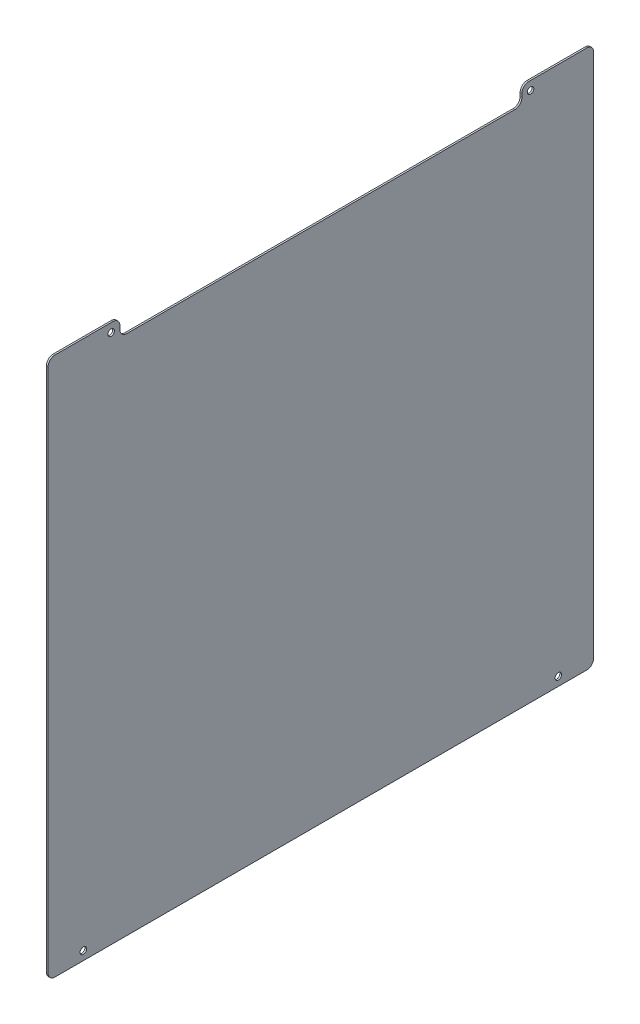
ISO-10303-21;
HEADER;
FILE_DESCRIPTION(('STEP AP214'),'2;1');
FILE_NAME('part.step','',(''),(''),'','','');
FILE_SCHEMA(('AUTOMOTIVE_DESIGN { 1 0 10303 214 1 1 1 1 }'));
ENDSEC;
DATA;
#1=APPLICATION_CONTEXT('core data for automotive mechanical design processes');
#2=APPLICATION_PROTOCOL_DEFINITION('international standard','automotive_design',2000,#1);
#3=PRODUCT_CONTEXT('',#1,'mechanical');
#4=PRODUCT('Part','Part','',(#3));
#5=PRODUCT_RELATED_PRODUCT_CATEGORY('part','',(#4));
#6=PRODUCT_DEFINITION_FORMATION('','',#4);
#7=PRODUCT_DEFINITION_CONTEXT('part definition',#1,'design');
#8=PRODUCT_DEFINITION('design','',#6,#7);
#9=PRODUCT_DEFINITION_SHAPE('','',#8);
#10=(LENGTH_UNIT() NAMED_UNIT(*) SI_UNIT(.MILLI.,.METRE.));
#11=(NAMED_UNIT(*) PLANE_ANGLE_UNIT() SI_UNIT($,.RADIAN.));
#12=(NAMED_UNIT(*) SI_UNIT($,.STERADIAN.) SOLID_ANGLE_UNIT());
#13=UNCERTAINTY_MEASURE_WITH_UNIT(LENGTH_MEASURE(1.E-05),#10,'distance_accuracy_value','');
#14=(GEOMETRIC_REPRESENTATION_CONTEXT(3) GLOBAL_UNCERTAINTY_ASSIGNED_CONTEXT((#13)) GLOBAL_UNIT_ASSIGNED_CONTEXT((#10,
#11,#12)) REPRESENTATION_CONTEXT('',''));
#15=CARTESIAN_POINT('',(0.,0.,0.));
#16=DIRECTION('',(0.,0.,1.));
#17=DIRECTION('',(1.,0.,0.));
#18=AXIS2_PLACEMENT_3D('',#15,#16,#17);
#19=CARTESIAN_POINT('',(-1.5875,6.35,-6.35));
#20=DIRECTION('',(1.,0.,0.));
#21=DIRECTION('',(0.,0.,-1.));
#22=AXIS2_PLACEMENT_3D('',#19,#20,#21);
#23=CYLINDRICAL_SURFACE('',#22,6.35);
#24=CARTESIAN_POINT('',(0.,6.35,-6.35));
#25=DIRECTION('',(1.,0.,0.));
#26=DIRECTION('',(0.,0.,1.));
#27=AXIS2_PLACEMENT_3D('',#24,#25,#26);
#28=CIRCLE('',#27,6.35);
#29=CARTESIAN_POINT('',(0.,6.35000000000004,0.));
#30=VERTEX_POINT('',#29);
#31=CARTESIAN_POINT('',(0.,0.,-6.35000000000004));
#32=VERTEX_POINT('',#31);
#33=EDGE_CURVE('E181',#30,#32,#28,.T.);
#34=ORIENTED_EDGE('',*,*,#33,.F.);
#35=DIRECTION('',(1.,0.,0.));
#36=VECTOR('',#35,1.);
#37=CARTESIAN_POINT('',(-1.5875,6.35000000000004,0.));
#38=LINE('',#37,#36);
#39=CARTESIAN_POINT('',(-1.5875,6.35000000000004,0.));
#40=VERTEX_POINT('',#39);
#41=EDGE_CURVE('E11',#40,#30,#38,.T.);
#42=ORIENTED_EDGE('',*,*,#41,.F.);
#43=CARTESIAN_POINT('',(-1.5875,6.35,-6.35));
#44=DIRECTION('',(1.,0.,0.));
#45=DIRECTION('',(0.,0.,1.));
#46=AXIS2_PLACEMENT_3D('',#43,#44,#45);
#47=CIRCLE('',#46,6.35);
#48=CARTESIAN_POINT('',(-1.5875,0.,-6.35000000000004));
#49=VERTEX_POINT('',#48);
#50=EDGE_CURVE('E226',#40,#49,#47,.T.);
#51=ORIENTED_EDGE('',*,*,#50,.T.);
#52=DIRECTION('',(1.,0.,0.));
#53=VECTOR('',#52,1.);
#54=CARTESIAN_POINT('',(-1.5875,0.,-6.35000000000004));
#55=LINE('',#54,#53);
#56=EDGE_CURVE('E115',#49,#32,#55,.T.);
#57=ORIENTED_EDGE('',*,*,#56,.T.);
#58=EDGE_LOOP('',(#34,#42,#51,#57));
#59=FACE_BOUND('',#58,.T.);
#60=ADVANCED_FACE('F35',(#59),#23,.T.);
#61=CARTESIAN_POINT('',(-1.5875,6.35000000000004,0.));
#62=DIRECTION('',(0.,0.,1.));
#63=DIRECTION('',(0.,-1.,0.));
#64=AXIS2_PLACEMENT_3D('',#61,#62,#63);
#65=PLANE('',#64);
#66=DIRECTION('',(0.,-1.,0.));
#67=VECTOR('',#66,1.);
#68=CARTESIAN_POINT('',(0.,6.35000000000004,0.));
#69=LINE('',#68,#67);
#70=CARTESIAN_POINT('',(0.,485.14,2.30718222304915E-13));
#71=VERTEX_POINT('',#70);
#72=EDGE_CURVE('E224',#71,#30,#69,.T.);
#73=ORIENTED_EDGE('',*,*,#72,.F.);
#74=DIRECTION('',(1.,0.,0.));
#75=VECTOR('',#74,1.);
#76=CARTESIAN_POINT('',(-1.5875,485.14,2.30718222304915E-13));
#77=LINE('',#76,#75);
#78=CARTESIAN_POINT('',(-1.5875,485.14,2.30718222304915E-13));
#79=VERTEX_POINT('',#78);
#80=EDGE_CURVE('E44',#79,#71,#77,.T.);
#81=ORIENTED_EDGE('',*,*,#80,.F.);
#82=DIRECTION('',(0.,-1.,0.));
#83=VECTOR('',#82,1.);
#84=CARTESIAN_POINT('',(-1.5875,6.35000000000004,0.));
#85=LINE('',#84,#83);
#86=EDGE_CURVE('E171',#79,#40,#85,.T.);
#87=ORIENTED_EDGE('',*,*,#86,.T.);
#88=ORIENTED_EDGE('',*,*,#41,.T.);
#89=EDGE_LOOP('',(#73,#81,#87,#88));
#90=FACE_BOUND('',#89,.T.);
#91=ADVANCED_FACE('F339',(#90),#65,.T.);
#92=CARTESIAN_POINT('',(-1.5875,485.14,-6.34999999999978));
#93=DIRECTION('',(1.,0.,0.));
#94=DIRECTION('',(0.,0.,-1.));
#95=AXIS2_PLACEMENT_3D('',#92,#93,#94);
#96=CYLINDRICAL_SURFACE('',#95,6.35000000000001);
#97=CARTESIAN_POINT('',(0.,485.14,-6.34999999999978));
#98=DIRECTION('',(1.,0.,0.));
#99=DIRECTION('',(0.,0.,-1.));
#100=AXIS2_PLACEMENT_3D('',#97,#98,#99);
#101=CIRCLE('',#100,6.35000000000001);
#102=CARTESIAN_POINT('',(0.,491.49,-6.34999999999982));
#103=VERTEX_POINT('',#102);
#104=EDGE_CURVE('E158',#103,#71,#101,.T.);
#105=ORIENTED_EDGE('',*,*,#104,.F.);
#106=DIRECTION('',(1.,0.,0.));
#107=VECTOR('',#106,1.);
#108=CARTESIAN_POINT('',(-1.5875,491.49,-6.34999999999982));
#109=LINE('',#108,#107);
#110=CARTESIAN_POINT('',(-1.5875,491.49,-6.34999999999982));
#111=VERTEX_POINT('',#110);
#112=EDGE_CURVE('E153',#111,#103,#109,.T.);
#113=ORIENTED_EDGE('',*,*,#112,.F.);
#114=CARTESIAN_POINT('',(-1.5875,485.14,-6.34999999999978));
#115=DIRECTION('',(1.,0.,0.));
#116=DIRECTION('',(0.,0.,-1.));
#117=AXIS2_PLACEMENT_3D('',#114,#115,#116);
#118=CIRCLE('',#117,6.35000000000001);
#119=EDGE_CURVE('E156',#111,#79,#118,.T.);
#120=ORIENTED_EDGE('',*,*,#119,.T.);
#121=ORIENTED_EDGE('',*,*,#80,.T.);
#122=EDGE_LOOP('',(#105,#113,#120,#121));
#123=FACE_BOUND('',#122,.T.);
#124=ADVANCED_FACE('F155',(#123),#96,.T.);
#125=CARTESIAN_POINT('',(-1.5875,491.49,-6.34999999999982));
#126=DIRECTION('',(0.,1.,0.));
#127=DIRECTION('',(0.,0.,1.));
#128=AXIS2_PLACEMENT_3D('',#125,#126,#127);
#129=PLANE('',#128);
#130=DIRECTION('',(0.,0.,1.));
#131=VECTOR('',#130,1.);
#132=CARTESIAN_POINT('',(0.,491.49,-6.34999999999982));
#133=LINE('',#132,#131);
#134=CARTESIAN_POINT('',(0.,491.49,-59.2074));
#135=VERTEX_POINT('',#134);
#136=EDGE_CURVE('E221',#135,#103,#133,.T.);
#137=ORIENTED_EDGE('',*,*,#136,.F.);
#138=DIRECTION('',(1.,0.,0.));
#139=VECTOR('',#138,1.);
#140=CARTESIAN_POINT('',(-1.5875,491.49,-59.2074));
#141=LINE('',#140,#139);
#142=CARTESIAN_POINT('',(-1.5875,491.49,-59.2074));
#143=VERTEX_POINT('',#142);
#144=EDGE_CURVE('E163',#143,#135,#141,.T.);
#145=ORIENTED_EDGE('',*,*,#144,.F.);
#146=DIRECTION('',(0.,0.,1.));
#147=VECTOR('',#146,1.);
#148=CARTESIAN_POINT('',(-1.5875,491.49,-6.34999999999982));
#149=LINE('',#148,#147);
#150=EDGE_CURVE('E169',#143,#111,#149,.T.);
#151=ORIENTED_EDGE('',*,*,#150,.T.);
#152=ORIENTED_EDGE('',*,*,#112,.T.);
#153=EDGE_LOOP('',(#137,#145,#151,#152));
#154=FACE_BOUND('',#153,.T.);
#155=ADVANCED_FACE('F173',(#154),#129,.T.);
#156=CARTESIAN_POINT('',(-1.5875,485.14,-59.2074));
#157=DIRECTION('',(1.,0.,0.));
#158=DIRECTION('',(0.,0.,-1.));
#159=AXIS2_PLACEMENT_3D('',#156,#157,#158);
#160=CYLINDRICAL_SURFACE('',#159,6.35000000000002);
#161=CARTESIAN_POINT('',(0.,485.14,-59.2074));
#162=DIRECTION('',(1.,0.,0.));
#163=DIRECTION('',(0.,0.,-1.));
#164=AXIS2_PLACEMENT_3D('',#161,#162,#163);
#165=CIRCLE('',#164,6.35000000000002);
#166=CARTESIAN_POINT('',(0.,485.14,-65.5574));
#167=VERTEX_POINT('',#166);
#168=EDGE_CURVE('E218',#167,#135,#165,.T.);
#169=ORIENTED_EDGE('',*,*,#168,.F.);
#170=DIRECTION('',(1.,0.,0.));
#171=VECTOR('',#170,1.);
#172=CARTESIAN_POINT('',(-1.5875,485.14,-65.5574));
#173=LINE('',#172,#171);
#174=CARTESIAN_POINT('',(-1.5875,485.14,-65.5574));
#175=VERTEX_POINT('',#174);
#176=EDGE_CURVE('E230',#175,#167,#173,.T.);
#177=ORIENTED_EDGE('',*,*,#176,.F.);
#178=CARTESIAN_POINT('',(-1.5875,485.14,-59.2074));
#179=DIRECTION('',(1.,0.,0.));
#180=DIRECTION('',(0.,0.,-1.));
#181=AXIS2_PLACEMENT_3D('',#178,#179,#180);
#182=CIRCLE('',#181,6.35000000000002);
#183=EDGE_CURVE('E174',#175,#143,#182,.T.);
#184=ORIENTED_EDGE('',*,*,#183,.T.);
#185=ORIENTED_EDGE('',*,*,#144,.T.);
#186=EDGE_LOOP('',(#169,#177,#184,#185));
#187=FACE_BOUND('',#186,.T.);
#188=ADVANCED_FACE('F352',(#187),#160,.T.);
#189=CARTESIAN_POINT('',(-1.5875,485.14,-65.5574));
#190=DIRECTION('',(0.,0.,-1.));
#191=DIRECTION('',(-1.,0.,0.));
#192=AXIS2_PLACEMENT_3D('',#189,#190,#191);
#193=PLANE('',#192);
#194=DIRECTION('',(0.,1.,0.));
#195=VECTOR('',#194,1.);
#196=CARTESIAN_POINT('',(0.,485.14,-65.5574));
#197=LINE('',#196,#195);
#198=CARTESIAN_POINT('',(0.,481.965,-65.5574));
#199=VERTEX_POINT('',#198);
#200=EDGE_CURVE('E215',#199,#167,#197,.T.);
#201=ORIENTED_EDGE('',*,*,#200,.F.);
#202=DIRECTION('',(1.,0.,0.));
#203=VECTOR('',#202,1.);
#204=CARTESIAN_POINT('',(-1.5875,481.965,-65.5574));
#205=LINE('',#204,#203);
#206=CARTESIAN_POINT('',(-1.5875,481.965,-65.5574));
#207=VERTEX_POINT('',#206);
#208=EDGE_CURVE('E232',#207,#199,#205,.T.);
#209=ORIENTED_EDGE('',*,*,#208,.F.);
#210=DIRECTION('',(0.,1.,0.));
#211=VECTOR('',#210,1.);
#212=CARTESIAN_POINT('',(-1.5875,485.14,-65.5574));
#213=LINE('',#212,#211);
#214=EDGE_CURVE('E176',#207,#175,#213,.T.);
#215=ORIENTED_EDGE('',*,*,#214,.T.);
#216=ORIENTED_EDGE('',*,*,#176,.T.);
#217=EDGE_LOOP('',(#201,#209,#215,#216));
#218=FACE_BOUND('',#217,.T.);
#219=ADVANCED_FACE('F298',(#218),#193,.T.);
#220=CARTESIAN_POINT('',(-1.5875,481.965,-71.9074));
#221=DIRECTION('',(1.,0.,0.));
#222=DIRECTION('',(0.,0.,-1.));
#223=AXIS2_PLACEMENT_3D('',#220,#221,#222);
#224=CYLINDRICAL_SURFACE('',#223,6.35);
#225=CARTESIAN_POINT('',(0.,481.965,-71.9074));
#226=DIRECTION('',(-1.,0.,0.));
#227=DIRECTION('',(0.,0.,1.));
#228=AXIS2_PLACEMENT_3D('',#225,#226,#227);
#229=CIRCLE('',#228,6.35);
#230=CARTESIAN_POINT('',(0.,475.615,-71.9074));
#231=VERTEX_POINT('',#230);
#232=EDGE_CURVE('E212',#231,#199,#229,.T.);
#233=ORIENTED_EDGE('',*,*,#232,.F.);
#234=DIRECTION('',(1.,0.,0.));
#235=VECTOR('',#234,1.);
#236=CARTESIAN_POINT('',(-1.5875,475.615,-71.9074));
#237=LINE('',#236,#235);
#238=CARTESIAN_POINT('',(-1.5875,475.615,-71.9074));
#239=VERTEX_POINT('',#238);
#240=EDGE_CURVE('E234',#239,#231,#237,.T.);
#241=ORIENTED_EDGE('',*,*,#240,.F.);
#242=CARTESIAN_POINT('',(-1.5875,481.965,-71.9074));
#243=DIRECTION('',(-1.,0.,0.));
#244=DIRECTION('',(0.,0.,1.));
#245=AXIS2_PLACEMENT_3D('',#242,#243,#244);
#246=CIRCLE('',#245,6.35);
#247=EDGE_CURVE('E292',#239,#207,#246,.T.);
#248=ORIENTED_EDGE('',*,*,#247,.T.);
#249=ORIENTED_EDGE('',*,*,#208,.T.);
#250=EDGE_LOOP('',(#233,#241,#248,#249));
#251=FACE_BOUND('',#250,.T.);
#252=ADVANCED_FACE('F304',(#251),#224,.F.);
#253=CARTESIAN_POINT('',(-1.5875,475.615,-71.9074));
#254=DIRECTION('',(0.,1.,0.));
#255=DIRECTION('',(0.,0.,1.));
#256=AXIS2_PLACEMENT_3D('',#253,#254,#255);
#257=PLANE('',#256);
#258=DIRECTION('',(0.,0.,1.));
#259=VECTOR('',#258,1.);
#260=CARTESIAN_POINT('',(0.,475.615,-71.9074));
#261=LINE('',#260,#259);
#262=CARTESIAN_POINT('',(0.,475.615,-425.9326));
#263=VERTEX_POINT('',#262);
#264=EDGE_CURVE('E209',#263,#231,#261,.T.);
#265=ORIENTED_EDGE('',*,*,#264,.F.);
#266=DIRECTION('',(1.,0.,0.));
#267=VECTOR('',#266,1.);
#268=CARTESIAN_POINT('',(-1.5875,475.615,-425.9326));
#269=LINE('',#268,#267);
#270=CARTESIAN_POINT('',(-1.5875,475.615,-425.9326));
#271=VERTEX_POINT('',#270);
#272=EDGE_CURVE('E236',#271,#263,#269,.T.);
#273=ORIENTED_EDGE('',*,*,#272,.F.);
#274=DIRECTION('',(0.,0.,1.));
#275=VECTOR('',#274,1.);
#276=CARTESIAN_POINT('',(-1.5875,475.615,-71.9074));
#277=LINE('',#276,#275);
#278=EDGE_CURVE('E289',#271,#239,#277,.T.);
#279=ORIENTED_EDGE('',*,*,#278,.T.);
#280=ORIENTED_EDGE('',*,*,#240,.T.);
#281=EDGE_LOOP('',(#265,#273,#279,#280));
#282=FACE_BOUND('',#281,.T.);
#283=ADVANCED_FACE('F307',(#282),#257,.T.);
#284=CARTESIAN_POINT('',(-1.5875,481.965,-425.9326));
#285=DIRECTION('',(1.,0.,0.));
#286=DIRECTION('',(0.,0.,-1.));
#287=AXIS2_PLACEMENT_3D('',#284,#285,#286);
#288=CYLINDRICAL_SURFACE('',#287,6.35000000000005);
#289=CARTESIAN_POINT('',(0.,481.965,-425.9326));
#290=DIRECTION('',(-1.,0.,0.));
#291=DIRECTION('',(0.,0.,1.));
#292=AXIS2_PLACEMENT_3D('',#289,#290,#291);
#293=CIRCLE('',#292,6.35000000000005);
#294=CARTESIAN_POINT('',(0.,481.965,-432.2826));
#295=VERTEX_POINT('',#294);
#296=EDGE_CURVE('E206',#295,#263,#293,.T.);
#297=ORIENTED_EDGE('',*,*,#296,.F.);
#298=DIRECTION('',(1.,0.,0.));
#299=VECTOR('',#298,1.);
#300=CARTESIAN_POINT('',(-1.5875,481.965,-432.2826));
#301=LINE('',#300,#299);
#302=CARTESIAN_POINT('',(-1.5875,481.965,-432.2826));
#303=VERTEX_POINT('',#302);
#304=EDGE_CURVE('E238',#303,#295,#301,.T.);
#305=ORIENTED_EDGE('',*,*,#304,.F.);
#306=CARTESIAN_POINT('',(-1.5875,481.965,-425.9326));
#307=DIRECTION('',(-1.,0.,0.));
#308=DIRECTION('',(0.,0.,1.));
#309=AXIS2_PLACEMENT_3D('',#306,#307,#308);
#310=CIRCLE('',#309,6.35000000000005);
#311=EDGE_CURVE('E286',#303,#271,#310,.T.);
#312=ORIENTED_EDGE('',*,*,#311,.T.);
#313=ORIENTED_EDGE('',*,*,#272,.T.);
#314=EDGE_LOOP('',(#297,#305,#312,#313));
#315=FACE_BOUND('',#314,.T.);
#316=ADVANCED_FACE('F312',(#315),#288,.F.);
#317=CARTESIAN_POINT('',(-1.5875,485.14,-432.2826));
#318=DIRECTION('',(0.,0.,1.));
#319=DIRECTION('',(1.,0.,0.));
#320=AXIS2_PLACEMENT_3D('',#317,#318,#319);
#321=PLANE('',#320);
#322=DIRECTION('',(0.,-1.,0.));
#323=VECTOR('',#322,1.);
#324=CARTESIAN_POINT('',(0.,485.14,-432.2826));
#325=LINE('',#324,#323);
#326=CARTESIAN_POINT('',(0.,485.14,-432.2826));
#327=VERTEX_POINT('',#326);
#328=EDGE_CURVE('E203',#327,#295,#325,.T.);
#329=ORIENTED_EDGE('',*,*,#328,.F.);
#330=DIRECTION('',(1.,0.,0.));
#331=VECTOR('',#330,1.);
#332=CARTESIAN_POINT('',(-1.5875,485.14,-432.2826));
#333=LINE('',#332,#331);
#334=CARTESIAN_POINT('',(-1.5875,485.14,-432.2826));
#335=VERTEX_POINT('',#334);
#336=EDGE_CURVE('E240',#335,#327,#333,.T.);
#337=ORIENTED_EDGE('',*,*,#336,.F.);
#338=DIRECTION('',(0.,-1.,0.));
#339=VECTOR('',#338,1.);
#340=CARTESIAN_POINT('',(-1.5875,485.14,-432.2826));
#341=LINE('',#340,#339);
#342=EDGE_CURVE('E283',#335,#303,#341,.T.);
#343=ORIENTED_EDGE('',*,*,#342,.T.);
#344=ORIENTED_EDGE('',*,*,#304,.T.);
#345=EDGE_LOOP('',(#329,#337,#343,#344));
#346=FACE_BOUND('',#345,.T.);
#347=ADVANCED_FACE('F315',(#346),#321,.T.);
#348=CARTESIAN_POINT('',(-1.5875,485.14,-438.6326));
#349=DIRECTION('',(1.,0.,0.));
#350=DIRECTION('',(0.,0.,-1.));
#351=AXIS2_PLACEMENT_3D('',#348,#349,#350);
#352=CYLINDRICAL_SURFACE('',#351,6.35000000000002);
#353=CARTESIAN_POINT('',(0.,485.14,-438.6326));
#354=DIRECTION('',(1.,0.,0.));
#355=DIRECTION('',(0.,0.,-1.));
#356=AXIS2_PLACEMENT_3D('',#353,#354,#355);
#357=CIRCLE('',#356,6.35000000000002);
#358=CARTESIAN_POINT('',(0.,491.49,-438.6326));
#359=VERTEX_POINT('',#358);
#360=EDGE_CURVE('E200',#359,#327,#357,.T.);
#361=ORIENTED_EDGE('',*,*,#360,.F.);
#362=DIRECTION('',(1.,0.,0.));
#363=VECTOR('',#362,1.);
#364=CARTESIAN_POINT('',(-1.5875,491.49,-438.6326));
#365=LINE('',#364,#363);
#366=CARTESIAN_POINT('',(-1.5875,491.49,-438.6326));
#367=VERTEX_POINT('',#366);
#368=EDGE_CURVE('E242',#367,#359,#365,.T.);
#369=ORIENTED_EDGE('',*,*,#368,.F.);
#370=CARTESIAN_POINT('',(-1.5875,485.14,-438.6326));
#371=DIRECTION('',(1.,0.,0.));
#372=DIRECTION('',(0.,0.,-1.));
#373=AXIS2_PLACEMENT_3D('',#370,#371,#372);
#374=CIRCLE('',#373,6.35000000000002);
#375=EDGE_CURVE('E280',#367,#335,#374,.T.);
#376=ORIENTED_EDGE('',*,*,#375,.T.);
#377=ORIENTED_EDGE('',*,*,#336,.T.);
#378=EDGE_LOOP('',(#361,#369,#376,#377));
#379=FACE_BOUND('',#378,.T.);
#380=ADVANCED_FACE('F320',(#379),#352,.T.);
#381=CARTESIAN_POINT('',(-1.5875,491.49,-438.6326));
#382=DIRECTION('',(0.,1.,0.));
#383=DIRECTION('',(0.,0.,1.));
#384=AXIS2_PLACEMENT_3D('',#381,#382,#383);
#385=PLANE('',#384);
#386=DIRECTION('',(0.,0.,1.));
#387=VECTOR('',#386,1.);
#388=CARTESIAN_POINT('',(0.,491.49,-438.6326));
#389=LINE('',#388,#387);
#390=CARTESIAN_POINT('',(0.,491.49,-491.49));
#391=VERTEX_POINT('',#390);
#392=EDGE_CURVE('E197',#391,#359,#389,.T.);
#393=ORIENTED_EDGE('',*,*,#392,.F.);
#394=DIRECTION('',(1.,0.,0.));
#395=VECTOR('',#394,1.);
#396=CARTESIAN_POINT('',(-1.5875,491.49,-491.49));
#397=LINE('',#396,#395);
#398=CARTESIAN_POINT('',(-1.5875,491.49,-491.49));
#399=VERTEX_POINT('',#398);
#400=EDGE_CURVE('E244',#399,#391,#397,.T.);
#401=ORIENTED_EDGE('',*,*,#400,.F.);
#402=DIRECTION('',(0.,0.,1.));
#403=VECTOR('',#402,1.);
#404=CARTESIAN_POINT('',(-1.5875,491.49,-438.6326));
#405=LINE('',#404,#403);
#406=EDGE_CURVE('E277',#399,#367,#405,.T.);
#407=ORIENTED_EDGE('',*,*,#406,.T.);
#408=ORIENTED_EDGE('',*,*,#368,.T.);
#409=EDGE_LOOP('',(#393,#401,#407,#408));
#410=FACE_BOUND('',#409,.T.);
#411=ADVANCED_FACE('F323',(#410),#385,.T.);
#412=CARTESIAN_POINT('',(-1.5875,485.14,-491.49));
#413=DIRECTION('',(1.,0.,0.));
#414=DIRECTION('',(0.,0.,-1.));
#415=AXIS2_PLACEMENT_3D('',#412,#413,#414);
#416=CYLINDRICAL_SURFACE('',#415,6.35000000000002);
#417=CARTESIAN_POINT('',(0.,485.14,-491.49));
#418=DIRECTION('',(1.,0.,0.));
#419=DIRECTION('',(0.,0.,-1.));
#420=AXIS2_PLACEMENT_3D('',#417,#418,#419);
#421=CIRCLE('',#420,6.35000000000002);
#422=CARTESIAN_POINT('',(0.,485.14,-497.84));
#423=VERTEX_POINT('',#422);
#424=EDGE_CURVE('E194',#423,#391,#421,.T.);
#425=ORIENTED_EDGE('',*,*,#424,.F.);
#426=DIRECTION('',(1.,0.,0.));
#427=VECTOR('',#426,1.);
#428=CARTESIAN_POINT('',(-1.5875,485.14,-497.84));
#429=LINE('',#428,#427);
#430=CARTESIAN_POINT('',(-1.5875,485.14,-497.84));
#431=VERTEX_POINT('',#430);
#432=EDGE_CURVE('E246',#431,#423,#429,.T.);
#433=ORIENTED_EDGE('',*,*,#432,.F.);
#434=CARTESIAN_POINT('',(-1.5875,485.14,-491.49));
#435=DIRECTION('',(1.,0.,0.));
#436=DIRECTION('',(0.,0.,-1.));
#437=AXIS2_PLACEMENT_3D('',#434,#435,#436);
#438=CIRCLE('',#437,6.35000000000002);
#439=EDGE_CURVE('E274',#431,#399,#438,.T.);
#440=ORIENTED_EDGE('',*,*,#439,.T.);
#441=ORIENTED_EDGE('',*,*,#400,.T.);
#442=EDGE_LOOP('',(#425,#433,#440,#441));
#443=FACE_BOUND('',#442,.T.);
#444=ADVANCED_FACE('F328',(#443),#416,.T.);
#445=CARTESIAN_POINT('',(-1.5875,6.35,-497.84));
#446=DIRECTION('',(0.,0.,-1.));
#447=DIRECTION('',(0.,1.,0.));
#448=AXIS2_PLACEMENT_3D('',#445,#446,#447);
#449=PLANE('',#448);
#450=DIRECTION('',(0.,1.,0.));
#451=VECTOR('',#450,1.);
#452=CARTESIAN_POINT('',(0.,6.35,-497.84));
#453=LINE('',#452,#451);
#454=CARTESIAN_POINT('',(0.,6.35,-497.84));
#455=VERTEX_POINT('',#454);
#456=EDGE_CURVE('E191',#455,#423,#453,.T.);
#457=ORIENTED_EDGE('',*,*,#456,.F.);
#458=DIRECTION('',(1.,0.,0.));
#459=VECTOR('',#458,1.);
#460=CARTESIAN_POINT('',(-1.5875,6.35,-497.84));
#461=LINE('',#460,#459);
#462=CARTESIAN_POINT('',(-1.5875,6.35,-497.84));
#463=VERTEX_POINT('',#462);
#464=EDGE_CURVE('E248',#463,#455,#461,.T.);
#465=ORIENTED_EDGE('',*,*,#464,.F.);
#466=DIRECTION('',(0.,1.,0.));
#467=VECTOR('',#466,1.);
#468=CARTESIAN_POINT('',(-1.5875,6.35,-497.84));
#469=LINE('',#468,#467);
#470=EDGE_CURVE('E271',#463,#431,#469,.T.);
#471=ORIENTED_EDGE('',*,*,#470,.T.);
#472=ORIENTED_EDGE('',*,*,#432,.T.);
#473=EDGE_LOOP('',(#457,#465,#471,#472));
#474=FACE_BOUND('',#473,.T.);
#475=ADVANCED_FACE('F331',(#474),#449,.T.);
#476=CARTESIAN_POINT('',(-1.5875,6.35,-491.49));
#477=DIRECTION('',(1.,0.,0.));
#478=DIRECTION('',(0.,0.,-1.));
#479=AXIS2_PLACEMENT_3D('',#476,#477,#478);
#480=CYLINDRICAL_SURFACE('',#479,6.35000000000001);
#481=CARTESIAN_POINT('',(0.,6.35,-491.49));
#482=DIRECTION('',(1.,0.,0.));
#483=DIRECTION('',(0.,0.,1.));
#484=AXIS2_PLACEMENT_3D('',#481,#482,#483);
#485=CIRCLE('',#484,6.35000000000001);
#486=CARTESIAN_POINT('',(0.,0.,-491.49));
#487=VERTEX_POINT('',#486);
#488=EDGE_CURVE('E188',#487,#455,#485,.T.);
#489=ORIENTED_EDGE('',*,*,#488,.F.);
#490=DIRECTION('',(1.,0.,0.));
#491=VECTOR('',#490,1.);
#492=CARTESIAN_POINT('',(-1.5875,0.,-491.49));
#493=LINE('',#492,#491);
#494=CARTESIAN_POINT('',(-1.5875,0.,-491.49));
#495=VERTEX_POINT('',#494);
#496=EDGE_CURVE('E250',#495,#487,#493,.T.);
#497=ORIENTED_EDGE('',*,*,#496,.F.);
#498=CARTESIAN_POINT('',(-1.5875,6.35,-491.49));
#499=DIRECTION('',(1.,0.,0.));
#500=DIRECTION('',(0.,0.,1.));
#501=AXIS2_PLACEMENT_3D('',#498,#499,#500);
#502=CIRCLE('',#501,6.35000000000001);
#503=EDGE_CURVE('E268',#495,#463,#502,.T.);
#504=ORIENTED_EDGE('',*,*,#503,.T.);
#505=ORIENTED_EDGE('',*,*,#464,.T.);
#506=EDGE_LOOP('',(#489,#497,#504,#505));
#507=FACE_BOUND('',#506,.T.);
#508=ADVANCED_FACE('F335',(#507),#480,.T.);
#509=CARTESIAN_POINT('',(-1.5875,0.,-6.35000000000004));
#510=DIRECTION('',(0.,-1.,0.));
#511=DIRECTION('',(0.,0.,-1.));
#512=AXIS2_PLACEMENT_3D('',#509,#510,#511);
#513=PLANE('',#512);
#514=DIRECTION('',(0.,0.,-1.));
#515=VECTOR('',#514,1.);
#516=CARTESIAN_POINT('',(0.,0.,-6.35000000000004));
#517=LINE('',#516,#515);
#518=EDGE_CURVE('E184',#32,#487,#517,.T.);
#519=ORIENTED_EDGE('',*,*,#518,.F.);
#520=ORIENTED_EDGE('',*,*,#56,.F.);
#521=DIRECTION('',(0.,0.,-1.));
#522=VECTOR('',#521,1.);
#523=CARTESIAN_POINT('',(-1.5875,0.,-6.35000000000004));
#524=LINE('',#523,#522);
#525=EDGE_CURVE('E266',#49,#495,#524,.T.);
#526=ORIENTED_EDGE('',*,*,#525,.T.);
#527=ORIENTED_EDGE('',*,*,#496,.T.);
#528=EDGE_LOOP('',(#519,#520,#526,#527));
#529=FACE_BOUND('',#528,.T.);
#530=ADVANCED_FACE('F336',(#529),#513,.T.);
#531=CARTESIAN_POINT('',(-1.5875,6.35,-6.35));
#532=DIRECTION('',(-1.,0.,0.));
#533=DIRECTION('',(0.,0.,1.));
#534=AXIS2_PLACEMENT_3D('',#531,#532,#533);
#535=PLANE('',#534);
#536=CARTESIAN_POINT('',(-1.5875,7.93750000000015,-32.2198999999994));
#537=DIRECTION('',(1.,0.,0.));
#538=DIRECTION('',(0.,0.,-1.));
#539=AXIS2_PLACEMENT_3D('',#536,#537,#538);
#540=CIRCLE('',#539,2.9718);
#541=CARTESIAN_POINT('',(-1.5875,7.93750000000015,-35.1916999999994));
#542=VERTEX_POINT('',#541);
#543=EDGE_CURVE('E406',#542,#542,#540,.T.);
#544=ORIENTED_EDGE('',*,*,#543,.T.);
#545=EDGE_LOOP('',(#544));
#546=FACE_BOUND('',#545,.T.);
#547=CARTESIAN_POINT('',(-1.5875,7.9374950633706,-465.6201));
#548=DIRECTION('',(1.,0.,0.));
#549=DIRECTION('',(0.,0.,-1.));
#550=AXIS2_PLACEMENT_3D('',#547,#548,#549);
#551=CIRCLE('',#550,2.9718);
#552=CARTESIAN_POINT('',(-1.5875,7.9374950633706,-468.5919));
#553=VERTEX_POINT('',#552);
#554=EDGE_CURVE('E410',#553,#553,#551,.T.);
#555=ORIENTED_EDGE('',*,*,#554,.T.);
#556=EDGE_LOOP('',(#555));
#557=FACE_BOUND('',#556,.T.);
#558=CARTESIAN_POINT('',(-1.5875,483.552495063371,-440.2201));
#559=DIRECTION('',(1.,0.,0.));
#560=DIRECTION('',(0.,0.,-1.));
#561=AXIS2_PLACEMENT_3D('',#558,#559,#560);
#562=CIRCLE('',#561,2.97180000000002);
#563=CARTESIAN_POINT('',(-1.5875,483.552495063371,-443.1919));
#564=VERTEX_POINT('',#563);
#565=EDGE_CURVE('E261',#564,#564,#562,.T.);
#566=ORIENTED_EDGE('',*,*,#565,.T.);
#567=EDGE_LOOP('',(#566));
#568=FACE_BOUND('',#567,.T.);
#569=CARTESIAN_POINT('',(-1.5875,483.552495063371,-57.6198999999997));
#570=DIRECTION('',(1.,0.,0.));
#571=DIRECTION('',(0.,0.,-1.));
#572=AXIS2_PLACEMENT_3D('',#569,#570,#571);
#573=CIRCLE('',#572,2.97180000000002);
#574=CARTESIAN_POINT('',(-1.5875,483.552495063371,-60.5916999999997));
#575=VERTEX_POINT('',#574);
#576=EDGE_CURVE('E253',#575,#575,#573,.T.);
#577=ORIENTED_EDGE('',*,*,#576,.T.);
#578=EDGE_LOOP('',(#577));
#579=FACE_BOUND('',#578,.T.);
#580=ORIENTED_EDGE('',*,*,#50,.F.);
#581=ORIENTED_EDGE('',*,*,#86,.F.);
#582=ORIENTED_EDGE('',*,*,#119,.F.);
#583=ORIENTED_EDGE('',*,*,#150,.F.);
#584=ORIENTED_EDGE('',*,*,#183,.F.);
#585=ORIENTED_EDGE('',*,*,#214,.F.);
#586=ORIENTED_EDGE('',*,*,#247,.F.);
#587=ORIENTED_EDGE('',*,*,#278,.F.);
#588=ORIENTED_EDGE('',*,*,#311,.F.);
#589=ORIENTED_EDGE('',*,*,#342,.F.);
#590=ORIENTED_EDGE('',*,*,#375,.F.);
#591=ORIENTED_EDGE('',*,*,#406,.F.);
#592=ORIENTED_EDGE('',*,*,#439,.F.);
#593=ORIENTED_EDGE('',*,*,#470,.F.);
#594=ORIENTED_EDGE('',*,*,#503,.F.);
#595=ORIENTED_EDGE('',*,*,#525,.F.);
#596=EDGE_LOOP('',(#580,#581,#582,#583,#584,#585,#586,#587,#588,#589,#590,#591,#592,#593,#594,#595));
#597=FACE_BOUND('',#596,.T.);
#598=ADVANCED_FACE('F167',(#546,#557,#568,#579,#597),#535,.T.);
#599=CARTESIAN_POINT('',(0.,6.35,-6.35));
#600=DIRECTION('',(-1.,0.,0.));
#601=DIRECTION('',(0.,0.,1.));
#602=AXIS2_PLACEMENT_3D('',#599,#600,#601);
#603=PLANE('',#602);
#604=CARTESIAN_POINT('',(0.,7.93750000000015,-32.2198999999994));
#605=DIRECTION('',(-1.,0.,0.));
#606=DIRECTION('',(0.,0.,1.));
#607=AXIS2_PLACEMENT_3D('',#604,#605,#606);
#608=CIRCLE('',#607,2.9718);
#609=CARTESIAN_POINT('',(0.,7.93750000000015,-29.2480999999994));
#610=VERTEX_POINT('',#609);
#611=EDGE_CURVE('E409',#610,#610,#608,.T.);
#612=ORIENTED_EDGE('',*,*,#611,.T.);
#613=EDGE_LOOP('',(#612));
#614=FACE_BOUND('',#613,.T.);
#615=CARTESIAN_POINT('',(0.,7.9374950633706,-465.6201));
#616=DIRECTION('',(-1.,0.,0.));
#617=DIRECTION('',(0.,0.,1.));
#618=AXIS2_PLACEMENT_3D('',#615,#616,#617);
#619=CIRCLE('',#618,2.9718);
#620=CARTESIAN_POINT('',(0.,7.9374950633706,-462.6483));
#621=VERTEX_POINT('',#620);
#622=EDGE_CURVE('E413',#621,#621,#619,.T.);
#623=ORIENTED_EDGE('',*,*,#622,.T.);
#624=EDGE_LOOP('',(#623));
#625=FACE_BOUND('',#624,.T.);
#626=CARTESIAN_POINT('',(0.,483.552495063371,-440.2201));
#627=DIRECTION('',(-1.,0.,0.));
#628=DIRECTION('',(0.,0.,1.));
#629=AXIS2_PLACEMENT_3D('',#626,#627,#628);
#630=CIRCLE('',#629,2.97180000000002);
#631=CARTESIAN_POINT('',(0.,483.552495063371,-437.2483));
#632=VERTEX_POINT('',#631);
#633=EDGE_CURVE('E38',#632,#632,#630,.T.);
#634=ORIENTED_EDGE('',*,*,#633,.T.);
#635=EDGE_LOOP('',(#634));
#636=FACE_BOUND('',#635,.T.);
#637=CARTESIAN_POINT('',(0.,483.552495063371,-57.6198999999997));
#638=DIRECTION('',(-1.,0.,0.));
#639=DIRECTION('',(0.,0.,1.));
#640=AXIS2_PLACEMENT_3D('',#637,#638,#639);
#641=CIRCLE('',#640,2.97180000000002);
#642=CARTESIAN_POINT('',(0.,483.552495063371,-54.6480999999997));
#643=VERTEX_POINT('',#642);
#644=EDGE_CURVE('E185',#643,#643,#641,.T.);
#645=ORIENTED_EDGE('',*,*,#644,.T.);
#646=EDGE_LOOP('',(#645));
#647=FACE_BOUND('',#646,.T.);
#648=ORIENTED_EDGE('',*,*,#33,.T.);
#649=ORIENTED_EDGE('',*,*,#518,.T.);
#650=ORIENTED_EDGE('',*,*,#488,.T.);
#651=ORIENTED_EDGE('',*,*,#456,.T.);
#652=ORIENTED_EDGE('',*,*,#424,.T.);
#653=ORIENTED_EDGE('',*,*,#392,.T.);
#654=ORIENTED_EDGE('',*,*,#360,.T.);
#655=ORIENTED_EDGE('',*,*,#328,.T.);
#656=ORIENTED_EDGE('',*,*,#296,.T.);
#657=ORIENTED_EDGE('',*,*,#264,.T.);
#658=ORIENTED_EDGE('',*,*,#232,.T.);
#659=ORIENTED_EDGE('',*,*,#200,.T.);
#660=ORIENTED_EDGE('',*,*,#168,.T.);
#661=ORIENTED_EDGE('',*,*,#136,.T.);
#662=ORIENTED_EDGE('',*,*,#104,.T.);
#663=ORIENTED_EDGE('',*,*,#72,.T.);
#664=EDGE_LOOP('',(#648,#649,#650,#651,#652,#653,#654,#655,#656,#657,#658,#659,#660,#661,#662,#663));
#665=FACE_BOUND('',#664,.T.);
#666=ADVANCED_FACE('F338',(#614,#625,#636,#647,#665),#603,.F.);
#667=CARTESIAN_POINT('',(1.02362,483.552495063371,-57.6198999999997));
#668=DIRECTION('',(1.,0.,0.));
#669=DIRECTION('',(0.,0.,-1.));
#670=AXIS2_PLACEMENT_3D('',#667,#668,#669);
#671=CYLINDRICAL_SURFACE('',#670,2.97180000000002);
#672=ORIENTED_EDGE('',*,*,#576,.F.);
#673=EDGE_LOOP('',(#672));
#674=FACE_BOUND('',#673,.T.);
#675=ORIENTED_EDGE('',*,*,#644,.F.);
#676=EDGE_LOOP('',(#675));
#677=FACE_BOUND('',#676,.T.);
#678=ADVANCED_FACE('F383',(#674,#677),#671,.F.);
#679=CARTESIAN_POINT('',(1.02362,483.552495063371,-440.2201));
#680=DIRECTION('',(1.,0.,0.));
#681=DIRECTION('',(0.,0.,-1.));
#682=AXIS2_PLACEMENT_3D('',#679,#680,#681);
#683=CYLINDRICAL_SURFACE('',#682,2.97180000000002);
#684=ORIENTED_EDGE('',*,*,#565,.F.);
#685=EDGE_LOOP('',(#684));
#686=FACE_BOUND('',#685,.T.);
#687=ORIENTED_EDGE('',*,*,#633,.F.);
#688=EDGE_LOOP('',(#687));
#689=FACE_BOUND('',#688,.T.);
#690=ADVANCED_FACE('F390',(#686,#689),#683,.F.);
#691=CARTESIAN_POINT('',(1.02362,7.9374950633706,-465.6201));
#692=DIRECTION('',(1.,0.,0.));
#693=DIRECTION('',(0.,0.,-1.));
#694=AXIS2_PLACEMENT_3D('',#691,#692,#693);
#695=CYLINDRICAL_SURFACE('',#694,2.9718);
#696=ORIENTED_EDGE('',*,*,#554,.F.);
#697=EDGE_LOOP('',(#696));
#698=FACE_BOUND('',#697,.T.);
#699=ORIENTED_EDGE('',*,*,#622,.F.);
#700=EDGE_LOOP('',(#699));
#701=FACE_BOUND('',#700,.T.);
#702=ADVANCED_FACE('F394',(#698,#701),#695,.F.);
#703=CARTESIAN_POINT('',(1.02362,7.93750000000015,-32.2198999999994));
#704=DIRECTION('',(1.,0.,0.));
#705=DIRECTION('',(0.,0.,-1.));
#706=AXIS2_PLACEMENT_3D('',#703,#704,#705);
#707=CYLINDRICAL_SURFACE('',#706,2.9718);
#708=ORIENTED_EDGE('',*,*,#543,.F.);
#709=EDGE_LOOP('',(#708));
#710=FACE_BOUND('',#709,.T.);
#711=ORIENTED_EDGE('',*,*,#611,.F.);
#712=EDGE_LOOP('',(#711));
#713=FACE_BOUND('',#712,.T.);
#714=ADVANCED_FACE('F398',(#710,#713),#707,.F.);
#715=CLOSED_SHELL('',(#60,#91,#124,#155,#188,#219,#252,#283,#316,#347,#380,#411,#444,#475,#508,
#530,#598,#666,#678,#690,#702,#714));
#716=MANIFOLD_SOLID_BREP('B2',#715);
#717=ADVANCED_BREP_SHAPE_REPRESENTATION('',(#18,#716),#14);
#718=SHAPE_DEFINITION_REPRESENTATION(#9,#717);
ENDSEC;
END-ISO-10303-21;
